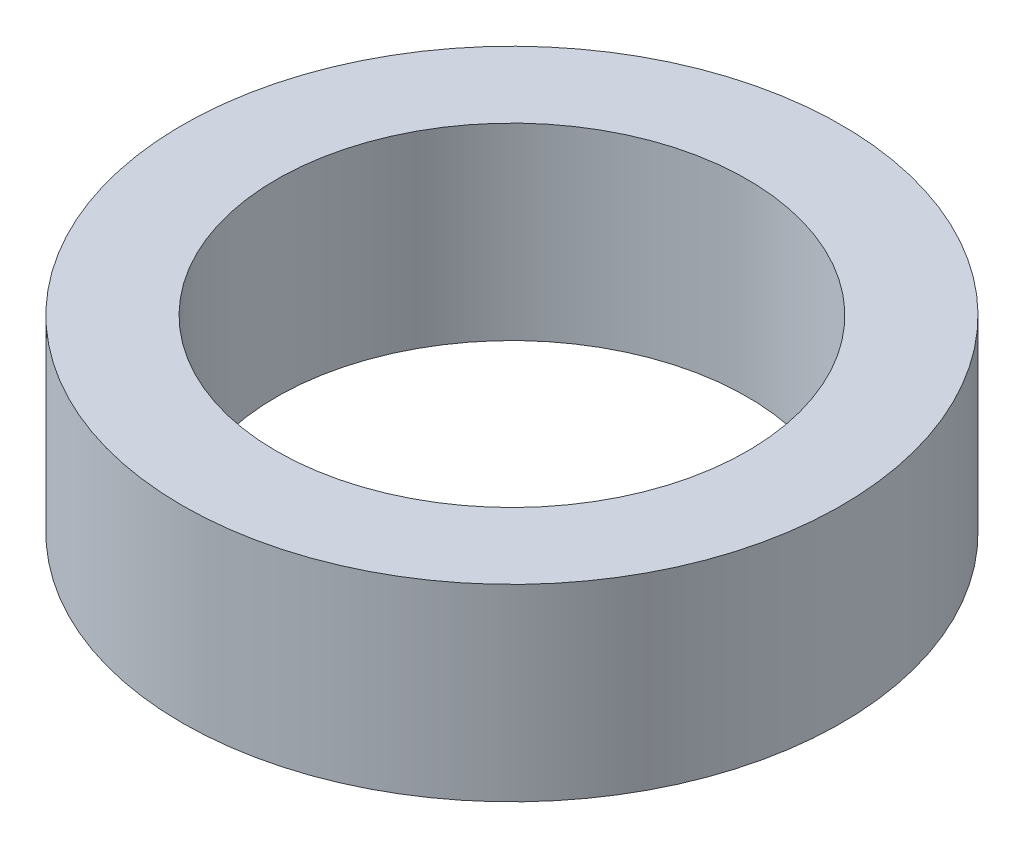
ISO-10303-21;
HEADER;
FILE_DESCRIPTION(('STEP AP214'),'2;1');
FILE_NAME('part.step','',(''),(''),'','','');
FILE_SCHEMA(('AUTOMOTIVE_DESIGN { 1 0 10303 214 1 1 1 1 }'));
ENDSEC;
DATA;
#1=APPLICATION_CONTEXT('core data for automotive mechanical design processes');
#2=APPLICATION_PROTOCOL_DEFINITION('international standard','automotive_design',2000,#1);
#3=PRODUCT_CONTEXT('',#1,'mechanical');
#4=PRODUCT('Part','Part','',(#3));
#5=PRODUCT_RELATED_PRODUCT_CATEGORY('part','',(#4));
#6=PRODUCT_DEFINITION_FORMATION('','',#4);
#7=PRODUCT_DEFINITION_CONTEXT('part definition',#1,'design');
#8=PRODUCT_DEFINITION('design','',#6,#7);
#9=PRODUCT_DEFINITION_SHAPE('','',#8);
#10=(LENGTH_UNIT() NAMED_UNIT(*) SI_UNIT(.MILLI.,.METRE.));
#11=(NAMED_UNIT(*) PLANE_ANGLE_UNIT() SI_UNIT($,.RADIAN.));
#12=(NAMED_UNIT(*) SI_UNIT($,.STERADIAN.) SOLID_ANGLE_UNIT());
#13=UNCERTAINTY_MEASURE_WITH_UNIT(LENGTH_MEASURE(1.E-05),#10,'distance_accuracy_value','');
#14=(GEOMETRIC_REPRESENTATION_CONTEXT(3) GLOBAL_UNCERTAINTY_ASSIGNED_CONTEXT((#13)) GLOBAL_UNIT_ASSIGNED_CONTEXT((#10,
#11,#12)) REPRESENTATION_CONTEXT('',''));
#15=CARTESIAN_POINT('',(0.,0.,0.));
#16=DIRECTION('',(0.,0.,1.));
#17=DIRECTION('',(1.,0.,0.));
#18=AXIS2_PLACEMENT_3D('',#15,#16,#17);
#19=CARTESIAN_POINT('',(0.,12.7,0.));
#20=DIRECTION('',(0.,1.,0.));
#21=DIRECTION('',(0.,0.,1.));
#22=AXIS2_PLACEMENT_3D('',#19,#20,#21);
#23=PLANE('',#22);
#24=CARTESIAN_POINT('',(0.,12.7,0.));
#25=DIRECTION('',(0.,1.,0.));
#26=DIRECTION('',(0.,0.,1.));
#27=AXIS2_PLACEMENT_3D('',#24,#25,#26);
#28=CIRCLE('',#27,22.225);
#29=CARTESIAN_POINT('',(0.,12.7,22.225));
#30=VERTEX_POINT('',#29);
#31=EDGE_CURVE('E10',#30,#30,#28,.T.);
#32=ORIENTED_EDGE('',*,*,#31,.T.);
#33=EDGE_LOOP('',(#32));
#34=FACE_BOUND('',#33,.T.);
#35=CARTESIAN_POINT('',(0.,12.7,0.));
#36=DIRECTION('',(0.,1.,0.));
#37=DIRECTION('',(0.,0.,1.));
#38=AXIS2_PLACEMENT_3D('',#35,#36,#37);
#39=CIRCLE('',#38,15.875);
#40=CARTESIAN_POINT('',(0.,12.7,15.875));
#41=VERTEX_POINT('',#40);
#42=EDGE_CURVE('E42',#41,#41,#39,.T.);
#43=ORIENTED_EDGE('',*,*,#42,.F.);
#44=EDGE_LOOP('',(#43));
#45=FACE_BOUND('',#44,.T.);
#46=ADVANCED_FACE('F31',(#34,#45),#23,.T.);
#47=CARTESIAN_POINT('',(0.,0.,0.));
#48=DIRECTION('',(0.,1.,0.));
#49=DIRECTION('',(0.,0.,1.));
#50=AXIS2_PLACEMENT_3D('',#47,#48,#49);
#51=PLANE('',#50);
#52=CARTESIAN_POINT('',(0.,0.,0.));
#53=DIRECTION('',(0.,1.,0.));
#54=DIRECTION('',(0.,0.,1.));
#55=AXIS2_PLACEMENT_3D('',#52,#53,#54);
#56=CIRCLE('',#55,22.225);
#57=CARTESIAN_POINT('',(0.,0.,22.225));
#58=VERTEX_POINT('',#57);
#59=EDGE_CURVE('E35',#58,#58,#56,.T.);
#60=ORIENTED_EDGE('',*,*,#59,.F.);
#61=EDGE_LOOP('',(#60));
#62=FACE_BOUND('',#61,.T.);
#63=CARTESIAN_POINT('',(0.,0.,0.));
#64=DIRECTION('',(0.,1.,0.));
#65=DIRECTION('',(0.,0.,1.));
#66=AXIS2_PLACEMENT_3D('',#63,#64,#65);
#67=CIRCLE('',#66,15.875);
#68=CARTESIAN_POINT('',(0.,0.,15.875));
#69=VERTEX_POINT('',#68);
#70=EDGE_CURVE('E44',#69,#69,#67,.T.);
#71=ORIENTED_EDGE('',*,*,#70,.T.);
#72=EDGE_LOOP('',(#71));
#73=FACE_BOUND('',#72,.T.);
#74=ADVANCED_FACE('F54',(#62,#73),#51,.F.);
#75=CARTESIAN_POINT('',(0.,12.7,0.));
#76=DIRECTION('',(0.,-1.,0.));
#77=DIRECTION('',(0.,0.,-1.));
#78=AXIS2_PLACEMENT_3D('',#75,#76,#77);
#79=CYLINDRICAL_SURFACE('',#78,22.225);
#80=ORIENTED_EDGE('',*,*,#31,.F.);
#81=EDGE_LOOP('',(#80));
#82=FACE_BOUND('',#81,.T.);
#83=ORIENTED_EDGE('',*,*,#59,.T.);
#84=EDGE_LOOP('',(#83));
#85=FACE_BOUND('',#84,.T.);
#86=ADVANCED_FACE('F33',(#82,#85),#79,.T.);
#87=CARTESIAN_POINT('',(0.,12.7,0.));
#88=DIRECTION('',(0.,-1.,0.));
#89=DIRECTION('',(0.,0.,-1.));
#90=AXIS2_PLACEMENT_3D('',#87,#88,#89);
#91=CYLINDRICAL_SURFACE('',#90,15.875);
#92=ORIENTED_EDGE('',*,*,#42,.T.);
#93=EDGE_LOOP('',(#92));
#94=FACE_BOUND('',#93,.T.);
#95=ORIENTED_EDGE('',*,*,#70,.F.);
#96=EDGE_LOOP('',(#95));
#97=FACE_BOUND('',#96,.T.);
#98=ADVANCED_FACE('F50',(#94,#97),#91,.F.);
#99=CLOSED_SHELL('',(#46,#74,#86,#98));
#100=MANIFOLD_SOLID_BREP('B2',#99);
#101=ADVANCED_BREP_SHAPE_REPRESENTATION('',(#18,#100),#14);
#102=SHAPE_DEFINITION_REPRESENTATION(#9,#101);
ENDSEC;
END-ISO-10303-21;
